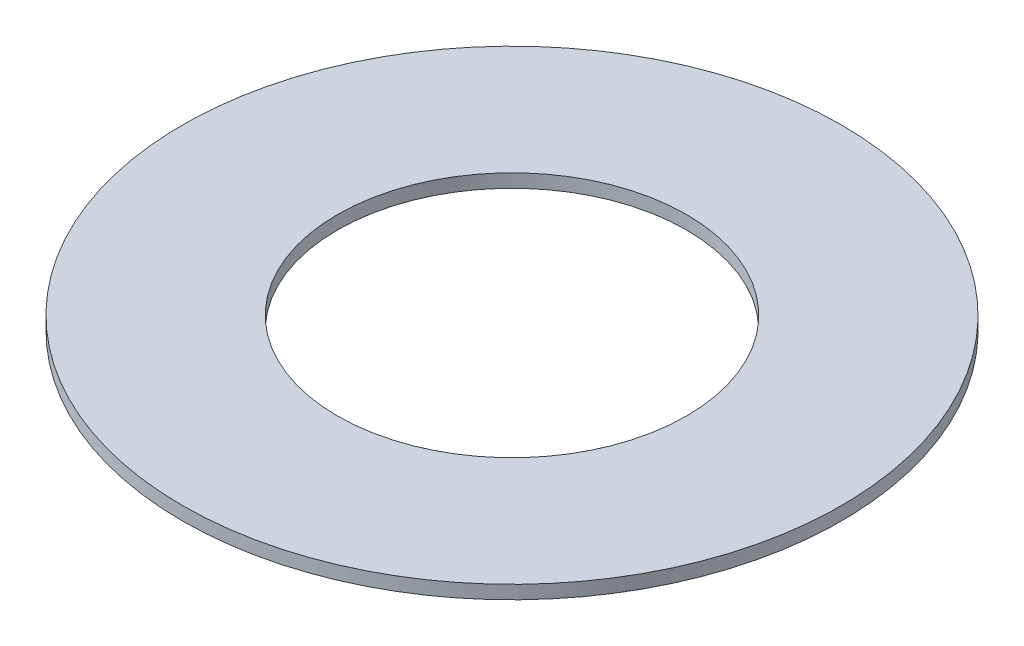
ISO-10303-21;
HEADER;
FILE_DESCRIPTION(('STEP AP214'),'2;1');
FILE_NAME('part.step','',(''),(''),'','','');
FILE_SCHEMA(('AUTOMOTIVE_DESIGN { 1 0 10303 214 1 1 1 1 }'));
ENDSEC;
DATA;
#1=APPLICATION_CONTEXT('core data for automotive mechanical design processes');
#2=APPLICATION_PROTOCOL_DEFINITION('international standard','automotive_design',2000,#1);
#3=PRODUCT_CONTEXT('',#1,'mechanical');
#4=PRODUCT('Part','Part','',(#3));
#5=PRODUCT_RELATED_PRODUCT_CATEGORY('part','',(#4));
#6=PRODUCT_DEFINITION_FORMATION('','',#4);
#7=PRODUCT_DEFINITION_CONTEXT('part definition',#1,'design');
#8=PRODUCT_DEFINITION('design','',#6,#7);
#9=PRODUCT_DEFINITION_SHAPE('','',#8);
#10=(LENGTH_UNIT() NAMED_UNIT(*) SI_UNIT(.MILLI.,.METRE.));
#11=(NAMED_UNIT(*) PLANE_ANGLE_UNIT() SI_UNIT($,.RADIAN.));
#12=(NAMED_UNIT(*) SI_UNIT($,.STERADIAN.) SOLID_ANGLE_UNIT());
#13=UNCERTAINTY_MEASURE_WITH_UNIT(LENGTH_MEASURE(1.E-05),#10,'distance_accuracy_value','');
#14=(GEOMETRIC_REPRESENTATION_CONTEXT(3) GLOBAL_UNCERTAINTY_ASSIGNED_CONTEXT((#13)) GLOBAL_UNIT_ASSIGNED_CONTEXT((#10,
#11,#12)) REPRESENTATION_CONTEXT('',''));
#15=CARTESIAN_POINT('',(0.,0.,0.));
#16=DIRECTION('',(0.,0.,1.));
#17=DIRECTION('',(1.,0.,0.));
#18=AXIS2_PLACEMENT_3D('',#15,#16,#17);
#19=CARTESIAN_POINT('',(0.,0.2,0.));
#20=DIRECTION('',(0.,1.,0.));
#21=DIRECTION('',(0.,0.,1.));
#22=AXIS2_PLACEMENT_3D('',#19,#20,#21);
#23=PLANE('',#22);
#24=CARTESIAN_POINT('',(0.,0.2,0.));
#25=DIRECTION('',(0.,1.,0.));
#26=DIRECTION('',(0.,0.,1.));
#27=AXIS2_PLACEMENT_3D('',#24,#25,#26);
#28=CIRCLE('',#27,4.91);
#29=CARTESIAN_POINT('',(0.,0.2,4.91));
#30=VERTEX_POINT('',#29);
#31=EDGE_CURVE('E10',#30,#30,#28,.T.);
#32=ORIENTED_EDGE('',*,*,#31,.T.);
#33=EDGE_LOOP('',(#32));
#34=FACE_BOUND('',#33,.T.);
#35=CARTESIAN_POINT('',(0.,0.2,0.));
#36=DIRECTION('',(0.,1.,0.));
#37=DIRECTION('',(0.,0.,1.));
#38=AXIS2_PLACEMENT_3D('',#35,#36,#37);
#39=CIRCLE('',#38,2.6);
#40=CARTESIAN_POINT('',(0.,0.2,2.6));
#41=VERTEX_POINT('',#40);
#42=EDGE_CURVE('E42',#41,#41,#39,.T.);
#43=ORIENTED_EDGE('',*,*,#42,.F.);
#44=EDGE_LOOP('',(#43));
#45=FACE_BOUND('',#44,.T.);
#46=ADVANCED_FACE('F31',(#34,#45),#23,.T.);
#47=CARTESIAN_POINT('',(0.,0.,0.));
#48=DIRECTION('',(0.,1.,0.));
#49=DIRECTION('',(0.,0.,1.));
#50=AXIS2_PLACEMENT_3D('',#47,#48,#49);
#51=PLANE('',#50);
#52=CARTESIAN_POINT('',(0.,0.,0.));
#53=DIRECTION('',(0.,1.,0.));
#54=DIRECTION('',(0.,0.,1.));
#55=AXIS2_PLACEMENT_3D('',#52,#53,#54);
#56=CIRCLE('',#55,4.91);
#57=CARTESIAN_POINT('',(0.,0.,4.91));
#58=VERTEX_POINT('',#57);
#59=EDGE_CURVE('E35',#58,#58,#56,.T.);
#60=ORIENTED_EDGE('',*,*,#59,.F.);
#61=EDGE_LOOP('',(#60));
#62=FACE_BOUND('',#61,.T.);
#63=CARTESIAN_POINT('',(0.,0.,0.));
#64=DIRECTION('',(0.,1.,0.));
#65=DIRECTION('',(0.,0.,1.));
#66=AXIS2_PLACEMENT_3D('',#63,#64,#65);
#67=CIRCLE('',#66,2.6);
#68=CARTESIAN_POINT('',(0.,0.,2.6));
#69=VERTEX_POINT('',#68);
#70=EDGE_CURVE('E44',#69,#69,#67,.T.);
#71=ORIENTED_EDGE('',*,*,#70,.T.);
#72=EDGE_LOOP('',(#71));
#73=FACE_BOUND('',#72,.T.);
#74=ADVANCED_FACE('F54',(#62,#73),#51,.F.);
#75=CARTESIAN_POINT('',(0.,0.2,0.));
#76=DIRECTION('',(0.,-1.,0.));
#77=DIRECTION('',(0.,0.,-1.));
#78=AXIS2_PLACEMENT_3D('',#75,#76,#77);
#79=CYLINDRICAL_SURFACE('',#78,4.91);
#80=ORIENTED_EDGE('',*,*,#31,.F.);
#81=EDGE_LOOP('',(#80));
#82=FACE_BOUND('',#81,.T.);
#83=ORIENTED_EDGE('',*,*,#59,.T.);
#84=EDGE_LOOP('',(#83));
#85=FACE_BOUND('',#84,.T.);
#86=ADVANCED_FACE('F33',(#82,#85),#79,.T.);
#87=CARTESIAN_POINT('',(0.,0.2,0.));
#88=DIRECTION('',(0.,-1.,0.));
#89=DIRECTION('',(0.,0.,-1.));
#90=AXIS2_PLACEMENT_3D('',#87,#88,#89);
#91=CYLINDRICAL_SURFACE('',#90,2.6);
#92=ORIENTED_EDGE('',*,*,#42,.T.);
#93=EDGE_LOOP('',(#92));
#94=FACE_BOUND('',#93,.T.);
#95=ORIENTED_EDGE('',*,*,#70,.F.);
#96=EDGE_LOOP('',(#95));
#97=FACE_BOUND('',#96,.T.);
#98=ADVANCED_FACE('F50',(#94,#97),#91,.F.);
#99=CLOSED_SHELL('',(#46,#74,#86,#98));
#100=MANIFOLD_SOLID_BREP('B2',#99);
#101=ADVANCED_BREP_SHAPE_REPRESENTATION('',(#18,#100),#14);
#102=SHAPE_DEFINITION_REPRESENTATION(#9,#101);
ENDSEC;
END-ISO-10303-21;
